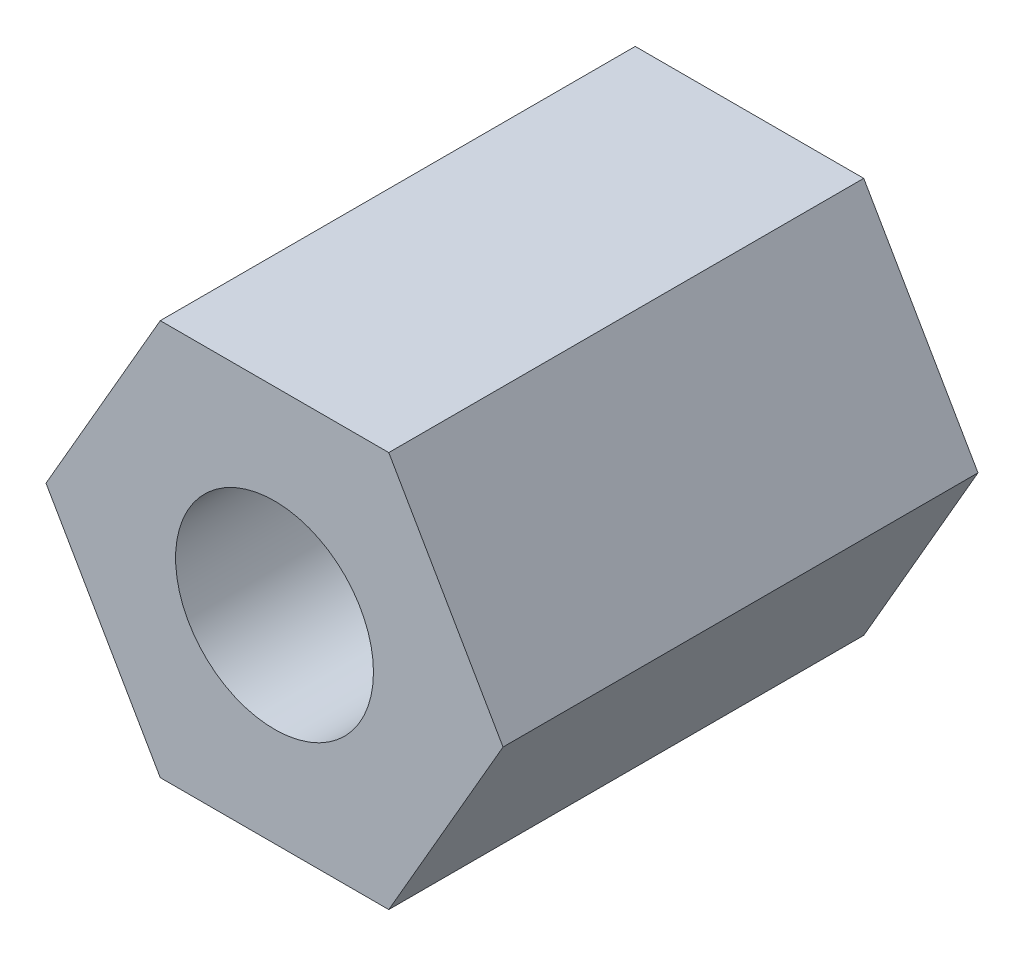
ISO-10303-21;
HEADER;
FILE_DESCRIPTION(('STEP AP214'),'2;1');
FILE_NAME('part.step','',(''),(''),'','','');
FILE_SCHEMA(('AUTOMOTIVE_DESIGN { 1 0 10303 214 1 1 1 1 }'));
ENDSEC;
DATA;
#1=APPLICATION_CONTEXT('core data for automotive mechanical design processes');
#2=APPLICATION_PROTOCOL_DEFINITION('international standard','automotive_design',2000,#1);
#3=PRODUCT_CONTEXT('',#1,'mechanical');
#4=PRODUCT('Part','Part','',(#3));
#5=PRODUCT_RELATED_PRODUCT_CATEGORY('part','',(#4));
#6=PRODUCT_DEFINITION_FORMATION('','',#4);
#7=PRODUCT_DEFINITION_CONTEXT('part definition',#1,'design');
#8=PRODUCT_DEFINITION('design','',#6,#7);
#9=PRODUCT_DEFINITION_SHAPE('','',#8);
#10=(LENGTH_UNIT() NAMED_UNIT(*) SI_UNIT(.MILLI.,.METRE.));
#11=(NAMED_UNIT(*) PLANE_ANGLE_UNIT() SI_UNIT($,.RADIAN.));
#12=(NAMED_UNIT(*) SI_UNIT($,.STERADIAN.) SOLID_ANGLE_UNIT());
#13=UNCERTAINTY_MEASURE_WITH_UNIT(LENGTH_MEASURE(1.E-05),#10,'distance_accuracy_value','');
#14=(GEOMETRIC_REPRESENTATION_CONTEXT(3) GLOBAL_UNCERTAINTY_ASSIGNED_CONTEXT((#13)) GLOBAL_UNIT_ASSIGNED_CONTEXT((#10,
#11,#12)) REPRESENTATION_CONTEXT('',''));
#15=CARTESIAN_POINT('',(0.,0.,0.));
#16=DIRECTION('',(0.,0.,1.));
#17=DIRECTION('',(1.,0.,0.));
#18=AXIS2_PLACEMENT_3D('',#15,#16,#17);
#19=CARTESIAN_POINT('',(2.88675134594813,0.,3.));
#20=DIRECTION('',(-0.866025403784438,-0.5,0.));
#21=DIRECTION('',(0.5,-0.866025403784439,0.));
#22=AXIS2_PLACEMENT_3D('',#19,#20,#21);
#23=PLANE('',#22);
#24=DIRECTION('',(-0.5,0.866025403784439,0.));
#25=VECTOR('',#24,1.);
#26=CARTESIAN_POINT('',(2.88675134594813,0.,-3.));
#27=LINE('',#26,#25);
#28=CARTESIAN_POINT('',(2.88675134594813,0.,-3.));
#29=VERTEX_POINT('',#28);
#30=CARTESIAN_POINT('',(1.44337567297407,2.5,-3.));
#31=VERTEX_POINT('',#30);
#32=EDGE_CURVE('E116',#29,#31,#27,.T.);
#33=ORIENTED_EDGE('',*,*,#32,.T.);
#34=DIRECTION('',(0.,0.,-1.));
#35=VECTOR('',#34,1.);
#36=CARTESIAN_POINT('',(1.44337567297407,2.5,3.));
#37=LINE('',#36,#35);
#38=CARTESIAN_POINT('',(1.44337567297407,2.5,3.));
#39=VERTEX_POINT('',#38);
#40=EDGE_CURVE('E11',#39,#31,#37,.T.);
#41=ORIENTED_EDGE('',*,*,#40,.F.);
#42=DIRECTION('',(-0.5,0.866025403784439,0.));
#43=VECTOR('',#42,1.);
#44=CARTESIAN_POINT('',(2.88675134594813,0.,3.));
#45=LINE('',#44,#43);
#46=CARTESIAN_POINT('',(2.88675134594813,0.,3.));
#47=VERTEX_POINT('',#46);
#48=EDGE_CURVE('E127',#47,#39,#45,.T.);
#49=ORIENTED_EDGE('',*,*,#48,.F.);
#50=DIRECTION('',(0.,0.,-1.));
#51=VECTOR('',#50,1.);
#52=CARTESIAN_POINT('',(2.88675134594813,0.,3.));
#53=LINE('',#52,#51);
#54=EDGE_CURVE('E112',#47,#29,#53,.T.);
#55=ORIENTED_EDGE('',*,*,#54,.T.);
#56=EDGE_LOOP('',(#33,#41,#49,#55));
#57=FACE_BOUND('',#56,.T.);
#58=ADVANCED_FACE('F32',(#57),#23,.F.);
#59=CARTESIAN_POINT('',(1.44337567297407,2.5,3.));
#60=DIRECTION('',(0.,-1.,0.));
#61=DIRECTION('',(1.,0.,0.));
#62=AXIS2_PLACEMENT_3D('',#59,#60,#61);
#63=PLANE('',#62);
#64=DIRECTION('',(-1.,0.,0.));
#65=VECTOR('',#64,1.);
#66=CARTESIAN_POINT('',(1.44337567297407,2.5,-3.));
#67=LINE('',#66,#65);
#68=CARTESIAN_POINT('',(-1.44337567297406,2.5,-3.));
#69=VERTEX_POINT('',#68);
#70=EDGE_CURVE('E119',#31,#69,#67,.T.);
#71=ORIENTED_EDGE('',*,*,#70,.T.);
#72=DIRECTION('',(0.,0.,-1.));
#73=VECTOR('',#72,1.);
#74=CARTESIAN_POINT('',(-1.44337567297406,2.5,3.));
#75=LINE('',#74,#73);
#76=CARTESIAN_POINT('',(-1.44337567297406,2.5,3.));
#77=VERTEX_POINT('',#76);
#78=EDGE_CURVE('E40',#77,#69,#75,.T.);
#79=ORIENTED_EDGE('',*,*,#78,.F.);
#80=DIRECTION('',(-1.,0.,0.));
#81=VECTOR('',#80,1.);
#82=CARTESIAN_POINT('',(1.44337567297407,2.5,3.));
#83=LINE('',#82,#81);
#84=EDGE_CURVE('E85',#39,#77,#83,.T.);
#85=ORIENTED_EDGE('',*,*,#84,.F.);
#86=ORIENTED_EDGE('',*,*,#40,.T.);
#87=EDGE_LOOP('',(#71,#79,#85,#86));
#88=FACE_BOUND('',#87,.T.);
#89=ADVANCED_FACE('F152',(#88),#63,.F.);
#90=CARTESIAN_POINT('',(-1.44337567297406,2.5,3.));
#91=DIRECTION('',(0.866025403784439,-0.5,0.));
#92=DIRECTION('',(0.5,0.866025403784439,0.));
#93=AXIS2_PLACEMENT_3D('',#90,#91,#92);
#94=PLANE('',#93);
#95=DIRECTION('',(-0.5,-0.866025403784439,0.));
#96=VECTOR('',#95,1.);
#97=CARTESIAN_POINT('',(-1.44337567297406,2.5,-3.));
#98=LINE('',#97,#96);
#99=CARTESIAN_POINT('',(-2.88675134594813,0.,-3.));
#100=VERTEX_POINT('',#99);
#101=EDGE_CURVE('E122',#69,#100,#98,.T.);
#102=ORIENTED_EDGE('',*,*,#101,.T.);
#103=DIRECTION('',(0.,0.,-1.));
#104=VECTOR('',#103,1.);
#105=CARTESIAN_POINT('',(-2.88675134594813,0.,3.));
#106=LINE('',#105,#104);
#107=CARTESIAN_POINT('',(-2.88675134594813,0.,3.));
#108=VERTEX_POINT('',#107);
#109=EDGE_CURVE('E107',#108,#100,#106,.T.);
#110=ORIENTED_EDGE('',*,*,#109,.F.);
#111=DIRECTION('',(-0.5,-0.866025403784439,0.));
#112=VECTOR('',#111,1.);
#113=CARTESIAN_POINT('',(-1.44337567297406,2.5,3.));
#114=LINE('',#113,#112);
#115=EDGE_CURVE('E98',#77,#108,#114,.T.);
#116=ORIENTED_EDGE('',*,*,#115,.F.);
#117=ORIENTED_EDGE('',*,*,#78,.T.);
#118=EDGE_LOOP('',(#102,#110,#116,#117));
#119=FACE_BOUND('',#118,.T.);
#120=ADVANCED_FACE('F133',(#119),#94,.F.);
#121=CARTESIAN_POINT('',(-2.88675134594813,0.,3.));
#122=DIRECTION('',(0.866025403784439,0.5,0.));
#123=DIRECTION('',(-0.5,0.866025403784439,0.));
#124=AXIS2_PLACEMENT_3D('',#121,#122,#123);
#125=PLANE('',#124);
#126=DIRECTION('',(0.5,-0.866025403784439,0.));
#127=VECTOR('',#126,1.);
#128=CARTESIAN_POINT('',(-2.88675134594813,0.,-3.));
#129=LINE('',#128,#127);
#130=CARTESIAN_POINT('',(-1.44337567297406,-2.5,-3.));
#131=VERTEX_POINT('',#130);
#132=EDGE_CURVE('E106',#100,#131,#129,.T.);
#133=ORIENTED_EDGE('',*,*,#132,.T.);
#134=DIRECTION('',(0.,0.,-1.));
#135=VECTOR('',#134,1.);
#136=CARTESIAN_POINT('',(-1.44337567297406,-2.5,3.));
#137=LINE('',#136,#135);
#138=CARTESIAN_POINT('',(-1.44337567297406,-2.5,3.));
#139=VERTEX_POINT('',#138);
#140=EDGE_CURVE('E103',#139,#131,#137,.T.);
#141=ORIENTED_EDGE('',*,*,#140,.F.);
#142=DIRECTION('',(0.5,-0.866025403784439,0.));
#143=VECTOR('',#142,1.);
#144=CARTESIAN_POINT('',(-2.88675134594813,0.,3.));
#145=LINE('',#144,#143);
#146=EDGE_CURVE('E92',#108,#139,#145,.T.);
#147=ORIENTED_EDGE('',*,*,#146,.F.);
#148=ORIENTED_EDGE('',*,*,#109,.T.);
#149=EDGE_LOOP('',(#133,#141,#147,#148));
#150=FACE_BOUND('',#149,.T.);
#151=ADVANCED_FACE('F104',(#150),#125,.F.);
#152=CARTESIAN_POINT('',(-1.44337567297406,-2.5,3.));
#153=DIRECTION('',(0.,1.,0.));
#154=DIRECTION('',(-1.,0.,0.));
#155=AXIS2_PLACEMENT_3D('',#152,#153,#154);
#156=PLANE('',#155);
#157=DIRECTION('',(1.,0.,0.));
#158=VECTOR('',#157,1.);
#159=CARTESIAN_POINT('',(-1.44337567297406,-2.5,-3.));
#160=LINE('',#159,#158);
#161=CARTESIAN_POINT('',(1.44337567297407,-2.5,-3.));
#162=VERTEX_POINT('',#161);
#163=EDGE_CURVE('E71',#131,#162,#160,.T.);
#164=ORIENTED_EDGE('',*,*,#163,.T.);
#165=DIRECTION('',(0.,0.,-1.));
#166=VECTOR('',#165,1.);
#167=CARTESIAN_POINT('',(1.44337567297407,-2.5,3.));
#168=LINE('',#167,#166);
#169=CARTESIAN_POINT('',(1.44337567297407,-2.5,3.));
#170=VERTEX_POINT('',#169);
#171=EDGE_CURVE('E108',#170,#162,#168,.T.);
#172=ORIENTED_EDGE('',*,*,#171,.F.);
#173=DIRECTION('',(1.,0.,0.));
#174=VECTOR('',#173,1.);
#175=CARTESIAN_POINT('',(-1.44337567297406,-2.5,3.));
#176=LINE('',#175,#174);
#177=EDGE_CURVE('E96',#139,#170,#176,.T.);
#178=ORIENTED_EDGE('',*,*,#177,.F.);
#179=ORIENTED_EDGE('',*,*,#140,.T.);
#180=EDGE_LOOP('',(#164,#172,#178,#179));
#181=FACE_BOUND('',#180,.T.);
#182=ADVANCED_FACE('F110',(#181),#156,.F.);
#183=CARTESIAN_POINT('',(1.44337567297407,-2.5,3.));
#184=DIRECTION('',(-0.866025403784439,0.5,0.));
#185=DIRECTION('',(-0.5,-0.866025403784439,0.));
#186=AXIS2_PLACEMENT_3D('',#183,#184,#185);
#187=PLANE('',#186);
#188=DIRECTION('',(0.5,0.866025403784439,0.));
#189=VECTOR('',#188,1.);
#190=CARTESIAN_POINT('',(1.44337567297407,-2.5,-3.));
#191=LINE('',#190,#189);
#192=EDGE_CURVE('E77',#162,#29,#191,.T.);
#193=ORIENTED_EDGE('',*,*,#192,.T.);
#194=ORIENTED_EDGE('',*,*,#54,.F.);
#195=DIRECTION('',(0.5,0.866025403784439,0.));
#196=VECTOR('',#195,1.);
#197=CARTESIAN_POINT('',(1.44337567297407,-2.5,3.));
#198=LINE('',#197,#196);
#199=EDGE_CURVE('E48',#170,#47,#198,.T.);
#200=ORIENTED_EDGE('',*,*,#199,.F.);
#201=ORIENTED_EDGE('',*,*,#171,.T.);
#202=EDGE_LOOP('',(#193,#194,#200,#201));
#203=FACE_BOUND('',#202,.T.);
#204=ADVANCED_FACE('F140',(#203),#187,.F.);
#205=CARTESIAN_POINT('',(0.,0.,3.));
#206=DIRECTION('',(0.,0.,1.));
#207=DIRECTION('',(1.,0.,0.));
#208=AXIS2_PLACEMENT_3D('',#205,#206,#207);
#209=PLANE('',#208);
#210=CARTESIAN_POINT('',(0.,0.,3.));
#211=DIRECTION('',(0.,0.,1.));
#212=DIRECTION('',(1.,0.,0.));
#213=AXIS2_PLACEMENT_3D('',#210,#211,#212);
#214=CIRCLE('',#213,1.25);
#215=CARTESIAN_POINT('',(1.25,0.,3.));
#216=VERTEX_POINT('',#215);
#217=EDGE_CURVE('E207',#216,#216,#214,.T.);
#218=ORIENTED_EDGE('',*,*,#217,.F.);
#219=EDGE_LOOP('',(#218));
#220=FACE_BOUND('',#219,.T.);
#221=ORIENTED_EDGE('',*,*,#48,.T.);
#222=ORIENTED_EDGE('',*,*,#84,.T.);
#223=ORIENTED_EDGE('',*,*,#115,.T.);
#224=ORIENTED_EDGE('',*,*,#146,.T.);
#225=ORIENTED_EDGE('',*,*,#177,.T.);
#226=ORIENTED_EDGE('',*,*,#199,.T.);
#227=EDGE_LOOP('',(#221,#222,#223,#224,#225,#226));
#228=FACE_BOUND('',#227,.T.);
#229=ADVANCED_FACE('F94',(#220,#228),#209,.T.);
#230=CARTESIAN_POINT('',(0.,0.,-3.));
#231=DIRECTION('',(0.,0.,1.));
#232=DIRECTION('',(1.,0.,0.));
#233=AXIS2_PLACEMENT_3D('',#230,#231,#232);
#234=PLANE('',#233);
#235=CARTESIAN_POINT('',(0.,0.,-3.));
#236=DIRECTION('',(0.,0.,1.));
#237=DIRECTION('',(1.,0.,0.));
#238=AXIS2_PLACEMENT_3D('',#235,#236,#237);
#239=CIRCLE('',#238,1.25);
#240=CARTESIAN_POINT('',(1.25,0.,-3.));
#241=VERTEX_POINT('',#240);
#242=EDGE_CURVE('E120',#241,#241,#239,.T.);
#243=ORIENTED_EDGE('',*,*,#242,.T.);
#244=EDGE_LOOP('',(#243));
#245=FACE_BOUND('',#244,.T.);
#246=ORIENTED_EDGE('',*,*,#32,.F.);
#247=ORIENTED_EDGE('',*,*,#192,.F.);
#248=ORIENTED_EDGE('',*,*,#163,.F.);
#249=ORIENTED_EDGE('',*,*,#132,.F.);
#250=ORIENTED_EDGE('',*,*,#101,.F.);
#251=ORIENTED_EDGE('',*,*,#70,.F.);
#252=EDGE_LOOP('',(#246,#247,#248,#249,#250,#251));
#253=FACE_BOUND('',#252,.T.);
#254=ADVANCED_FACE('F136',(#245,#253),#234,.F.);
#255=CARTESIAN_POINT('',(0.,0.,-3.));
#256=DIRECTION('',(0.,0.,1.));
#257=DIRECTION('',(1.,0.,0.));
#258=AXIS2_PLACEMENT_3D('',#255,#256,#257);
#259=CYLINDRICAL_SURFACE('',#258,1.25);
#260=ORIENTED_EDGE('',*,*,#242,.F.);
#261=EDGE_LOOP('',(#260));
#262=FACE_BOUND('',#261,.T.);
#263=ORIENTED_EDGE('',*,*,#217,.T.);
#264=EDGE_LOOP('',(#263));
#265=FACE_BOUND('',#264,.T.);
#266=ADVANCED_FACE('F189',(#262,#265),#259,.F.);
#267=CLOSED_SHELL('',(#58,#89,#120,#151,#182,#204,#229,#254,#266));
#268=MANIFOLD_SOLID_BREP('B2',#267);
#269=ADVANCED_BREP_SHAPE_REPRESENTATION('',(#18,#268),#14);
#270=SHAPE_DEFINITION_REPRESENTATION(#9,#269);
ENDSEC;
END-ISO-10303-21;
